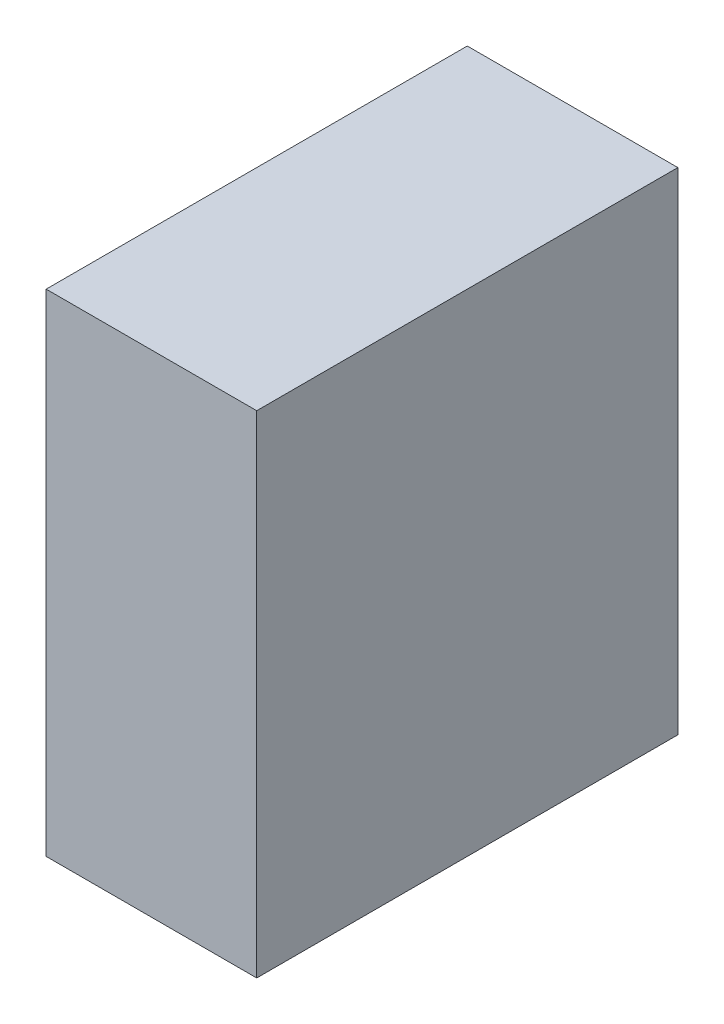
ISO-10303-21;
HEADER;
FILE_DESCRIPTION(('STEP AP214'),'2;1');
FILE_NAME('part.step','',(''),(''),'','','');
FILE_SCHEMA(('AUTOMOTIVE_DESIGN { 1 0 10303 214 1 1 1 1 }'));
ENDSEC;
DATA;
#1=APPLICATION_CONTEXT('core data for automotive mechanical design processes');
#2=APPLICATION_PROTOCOL_DEFINITION('international standard','automotive_design',2000,#1);
#3=PRODUCT_CONTEXT('',#1,'mechanical');
#4=PRODUCT('Part','Part','',(#3));
#5=PRODUCT_RELATED_PRODUCT_CATEGORY('part','',(#4));
#6=PRODUCT_DEFINITION_FORMATION('','',#4);
#7=PRODUCT_DEFINITION_CONTEXT('part definition',#1,'design');
#8=PRODUCT_DEFINITION('design','',#6,#7);
#9=PRODUCT_DEFINITION_SHAPE('','',#8);
#10=(LENGTH_UNIT() NAMED_UNIT(*) SI_UNIT(.MILLI.,.METRE.));
#11=(NAMED_UNIT(*) PLANE_ANGLE_UNIT() SI_UNIT($,.RADIAN.));
#12=(NAMED_UNIT(*) SI_UNIT($,.STERADIAN.) SOLID_ANGLE_UNIT());
#13=UNCERTAINTY_MEASURE_WITH_UNIT(LENGTH_MEASURE(1.E-05),#10,'distance_accuracy_value','');
#14=(GEOMETRIC_REPRESENTATION_CONTEXT(3) GLOBAL_UNCERTAINTY_ASSIGNED_CONTEXT((#13)) GLOBAL_UNIT_ASSIGNED_CONTEXT((#10,
#11,#12)) REPRESENTATION_CONTEXT('',''));
#15=CARTESIAN_POINT('',(0.,0.,0.));
#16=DIRECTION('',(0.,0.,1.));
#17=DIRECTION('',(1.,0.,0.));
#18=AXIS2_PLACEMENT_3D('',#15,#16,#17);
#19=CARTESIAN_POINT('',(0.,0.,60.));
#20=DIRECTION('',(1.,0.,0.));
#21=DIRECTION('',(0.,0.,-1.));
#22=AXIS2_PLACEMENT_3D('',#19,#20,#21);
#23=PLANE('',#22);
#24=DIRECTION('',(0.,-1.,0.));
#25=VECTOR('',#24,1.);
#26=CARTESIAN_POINT('',(0.,0.,0.));
#27=LINE('',#26,#25);
#28=CARTESIAN_POINT('',(0.,70.,0.));
#29=VERTEX_POINT('',#28);
#30=CARTESIAN_POINT('',(0.,0.,0.));
#31=VERTEX_POINT('',#30);
#32=EDGE_CURVE('E96',#29,#31,#27,.T.);
#33=ORIENTED_EDGE('',*,*,#32,.T.);
#34=DIRECTION('',(0.,0.,-1.));
#35=VECTOR('',#34,1.);
#36=CARTESIAN_POINT('',(0.,0.,60.));
#37=LINE('',#36,#35);
#38=CARTESIAN_POINT('',(0.,0.,60.));
#39=VERTEX_POINT('',#38);
#40=EDGE_CURVE('E11',#39,#31,#37,.T.);
#41=ORIENTED_EDGE('',*,*,#40,.F.);
#42=DIRECTION('',(0.,-1.,0.));
#43=VECTOR('',#42,1.);
#44=CARTESIAN_POINT('',(0.,0.,60.));
#45=LINE('',#44,#43);
#46=CARTESIAN_POINT('',(0.,70.,60.));
#47=VERTEX_POINT('',#46);
#48=EDGE_CURVE('E84',#47,#39,#45,.T.);
#49=ORIENTED_EDGE('',*,*,#48,.F.);
#50=DIRECTION('',(0.,0.,-1.));
#51=VECTOR('',#50,1.);
#52=CARTESIAN_POINT('',(0.,70.,60.));
#53=LINE('',#52,#51);
#54=EDGE_CURVE('E92',#47,#29,#53,.T.);
#55=ORIENTED_EDGE('',*,*,#54,.T.);
#56=EDGE_LOOP('',(#33,#41,#49,#55));
#57=FACE_BOUND('',#56,.T.);
#58=ADVANCED_FACE('F33',(#57),#23,.F.);
#59=CARTESIAN_POINT('',(0.,0.,60.));
#60=DIRECTION('',(0.,1.,0.));
#61=DIRECTION('',(0.,0.,1.));
#62=AXIS2_PLACEMENT_3D('',#59,#60,#61);
#63=PLANE('',#62);
#64=DIRECTION('',(1.,0.,0.));
#65=VECTOR('',#64,1.);
#66=CARTESIAN_POINT('',(0.,0.,0.));
#67=LINE('',#66,#65);
#68=CARTESIAN_POINT('',(30.,0.,0.));
#69=VERTEX_POINT('',#68);
#70=EDGE_CURVE('E88',#31,#69,#67,.T.);
#71=ORIENTED_EDGE('',*,*,#70,.T.);
#72=DIRECTION('',(0.,0.,-1.));
#73=VECTOR('',#72,1.);
#74=CARTESIAN_POINT('',(30.,0.,60.));
#75=LINE('',#74,#73);
#76=CARTESIAN_POINT('',(30.,0.,60.));
#77=VERTEX_POINT('',#76);
#78=EDGE_CURVE('E41',#77,#69,#75,.T.);
#79=ORIENTED_EDGE('',*,*,#78,.F.);
#80=DIRECTION('',(1.,0.,0.));
#81=VECTOR('',#80,1.);
#82=CARTESIAN_POINT('',(0.,0.,60.));
#83=LINE('',#82,#81);
#84=EDGE_CURVE('E79',#39,#77,#83,.T.);
#85=ORIENTED_EDGE('',*,*,#84,.F.);
#86=ORIENTED_EDGE('',*,*,#40,.T.);
#87=EDGE_LOOP('',(#71,#79,#85,#86));
#88=FACE_BOUND('',#87,.T.);
#89=ADVANCED_FACE('F87',(#88),#63,.F.);
#90=CARTESIAN_POINT('',(30.,0.,60.));
#91=DIRECTION('',(-1.,0.,0.));
#92=DIRECTION('',(0.,0.,1.));
#93=AXIS2_PLACEMENT_3D('',#90,#91,#92);
#94=PLANE('',#93);
#95=DIRECTION('',(0.,1.,0.));
#96=VECTOR('',#95,1.);
#97=CARTESIAN_POINT('',(30.,0.,0.));
#98=LINE('',#97,#96);
#99=CARTESIAN_POINT('',(30.,70.,0.));
#100=VERTEX_POINT('',#99);
#101=EDGE_CURVE('E66',#69,#100,#98,.T.);
#102=ORIENTED_EDGE('',*,*,#101,.T.);
#103=DIRECTION('',(0.,0.,-1.));
#104=VECTOR('',#103,1.);
#105=CARTESIAN_POINT('',(30.,70.,60.));
#106=LINE('',#105,#104);
#107=CARTESIAN_POINT('',(30.,70.,60.));
#108=VERTEX_POINT('',#107);
#109=EDGE_CURVE('E89',#108,#100,#106,.T.);
#110=ORIENTED_EDGE('',*,*,#109,.F.);
#111=DIRECTION('',(0.,1.,0.));
#112=VECTOR('',#111,1.);
#113=CARTESIAN_POINT('',(30.,0.,60.));
#114=LINE('',#113,#112);
#115=EDGE_CURVE('E82',#77,#108,#114,.T.);
#116=ORIENTED_EDGE('',*,*,#115,.F.);
#117=ORIENTED_EDGE('',*,*,#78,.T.);
#118=EDGE_LOOP('',(#102,#110,#116,#117));
#119=FACE_BOUND('',#118,.T.);
#120=ADVANCED_FACE('F90',(#119),#94,.F.);
#121=CARTESIAN_POINT('',(0.,70.,60.));
#122=DIRECTION('',(0.,-1.,0.));
#123=DIRECTION('',(0.,0.,-1.));
#124=AXIS2_PLACEMENT_3D('',#121,#122,#123);
#125=PLANE('',#124);
#126=DIRECTION('',(-1.,0.,0.));
#127=VECTOR('',#126,1.);
#128=CARTESIAN_POINT('',(0.,70.,0.));
#129=LINE('',#128,#127);
#130=EDGE_CURVE('E72',#100,#29,#129,.T.);
#131=ORIENTED_EDGE('',*,*,#130,.T.);
#132=ORIENTED_EDGE('',*,*,#54,.F.);
#133=DIRECTION('',(-1.,0.,0.));
#134=VECTOR('',#133,1.);
#135=CARTESIAN_POINT('',(0.,70.,60.));
#136=LINE('',#135,#134);
#137=EDGE_CURVE('E49',#108,#47,#136,.T.);
#138=ORIENTED_EDGE('',*,*,#137,.F.);
#139=ORIENTED_EDGE('',*,*,#109,.T.);
#140=EDGE_LOOP('',(#131,#132,#138,#139));
#141=FACE_BOUND('',#140,.T.);
#142=ADVANCED_FACE('F103',(#141),#125,.F.);
#143=CARTESIAN_POINT('',(0.,70.,60.));
#144=DIRECTION('',(0.,0.,-1.));
#145=DIRECTION('',(-1.,0.,0.));
#146=AXIS2_PLACEMENT_3D('',#143,#144,#145);
#147=PLANE('',#146);
#148=ORIENTED_EDGE('',*,*,#48,.T.);
#149=ORIENTED_EDGE('',*,*,#84,.T.);
#150=ORIENTED_EDGE('',*,*,#115,.T.);
#151=ORIENTED_EDGE('',*,*,#137,.T.);
#152=EDGE_LOOP('',(#148,#149,#150,#151));
#153=FACE_BOUND('',#152,.T.);
#154=ADVANCED_FACE('F80',(#153),#147,.F.);
#155=CARTESIAN_POINT('',(0.,70.,0.));
#156=DIRECTION('',(0.,0.,-1.));
#157=DIRECTION('',(-1.,0.,0.));
#158=AXIS2_PLACEMENT_3D('',#155,#156,#157);
#159=PLANE('',#158);
#160=ORIENTED_EDGE('',*,*,#32,.F.);
#161=ORIENTED_EDGE('',*,*,#130,.F.);
#162=ORIENTED_EDGE('',*,*,#101,.F.);
#163=ORIENTED_EDGE('',*,*,#70,.F.);
#164=EDGE_LOOP('',(#160,#161,#162,#163));
#165=FACE_BOUND('',#164,.T.);
#166=ADVANCED_FACE('F106',(#165),#159,.T.);
#167=CLOSED_SHELL('',(#58,#89,#120,#142,#154,#166));
#168=MANIFOLD_SOLID_BREP('B2',#167);
#169=ADVANCED_BREP_SHAPE_REPRESENTATION('',(#18,#168),#14);
#170=SHAPE_DEFINITION_REPRESENTATION(#9,#169);
ENDSEC;
END-ISO-10303-21;
